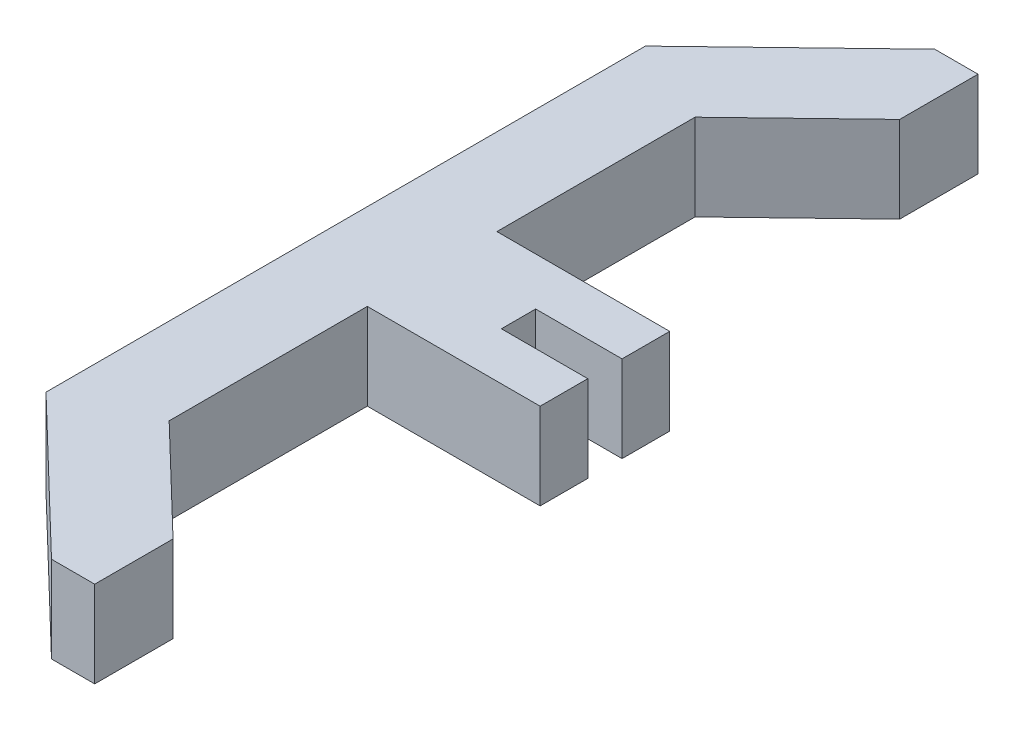
ISO-10303-21;
HEADER;
FILE_DESCRIPTION(('STEP AP214'),'2;1');
FILE_NAME('part.step','',(''),(''),'','','');
FILE_SCHEMA(('AUTOMOTIVE_DESIGN { 1 0 10303 214 1 1 1 1 }'));
ENDSEC;
DATA;
#1=APPLICATION_CONTEXT('core data for automotive mechanical design processes');
#2=APPLICATION_PROTOCOL_DEFINITION('international standard','automotive_design',2000,#1);
#3=PRODUCT_CONTEXT('',#1,'mechanical');
#4=PRODUCT('Part','Part','',(#3));
#5=PRODUCT_RELATED_PRODUCT_CATEGORY('part','',(#4));
#6=PRODUCT_DEFINITION_FORMATION('','',#4);
#7=PRODUCT_DEFINITION_CONTEXT('part definition',#1,'design');
#8=PRODUCT_DEFINITION('design','',#6,#7);
#9=PRODUCT_DEFINITION_SHAPE('','',#8);
#10=(LENGTH_UNIT() NAMED_UNIT(*) SI_UNIT(.MILLI.,.METRE.));
#11=(NAMED_UNIT(*) PLANE_ANGLE_UNIT() SI_UNIT($,.RADIAN.));
#12=(NAMED_UNIT(*) SI_UNIT($,.STERADIAN.) SOLID_ANGLE_UNIT());
#13=UNCERTAINTY_MEASURE_WITH_UNIT(LENGTH_MEASURE(1.E-05),#10,'distance_accuracy_value','');
#14=(GEOMETRIC_REPRESENTATION_CONTEXT(3) GLOBAL_UNCERTAINTY_ASSIGNED_CONTEXT((#13)) GLOBAL_UNIT_ASSIGNED_CONTEXT((#10,
#11,#12)) REPRESENTATION_CONTEXT('',''));
#15=CARTESIAN_POINT('',(0.,0.,0.));
#16=DIRECTION('',(0.,0.,1.));
#17=DIRECTION('',(1.,0.,0.));
#18=AXIS2_PLACEMENT_3D('',#15,#16,#17);
#19=CARTESIAN_POINT('',(-4.35,-75.2,-0.396875));
#20=DIRECTION('',(-1.,0.,0.));
#21=DIRECTION('',(0.,0.,1.));
#22=AXIS2_PLACEMENT_3D('',#19,#20,#21);
#23=PLANE('',#22);
#24=DIRECTION('',(0.,0.,-1.));
#25=VECTOR('',#24,1.);
#26=CARTESIAN_POINT('',(-4.35,-77.2,-0.396875));
#27=LINE('',#26,#25);
#28=CARTESIAN_POINT('',(-4.35,-77.2,-0.396875));
#29=VERTEX_POINT('',#28);
#30=CARTESIAN_POINT('',(-4.35,-77.2,-1.5));
#31=VERTEX_POINT('',#30);
#32=EDGE_CURVE('E190',#29,#31,#27,.T.);
#33=ORIENTED_EDGE('',*,*,#32,.T.);
#34=DIRECTION('',(0.,-1.,0.));
#35=VECTOR('',#34,1.);
#36=CARTESIAN_POINT('',(-4.35,-75.2,-1.5));
#37=LINE('',#36,#35);
#38=CARTESIAN_POINT('',(-4.35,-75.2,-1.5));
#39=VERTEX_POINT('',#38);
#40=EDGE_CURVE('E11',#39,#31,#37,.T.);
#41=ORIENTED_EDGE('',*,*,#40,.F.);
#42=DIRECTION('',(0.,0.,-1.));
#43=VECTOR('',#42,1.);
#44=CARTESIAN_POINT('',(-4.35,-75.2,-0.396875));
#45=LINE('',#44,#43);
#46=CARTESIAN_POINT('',(-4.35,-75.2,-0.396875));
#47=VERTEX_POINT('',#46);
#48=EDGE_CURVE('E233',#47,#39,#45,.T.);
#49=ORIENTED_EDGE('',*,*,#48,.F.);
#50=DIRECTION('',(0.,-1.,0.));
#51=VECTOR('',#50,1.);
#52=CARTESIAN_POINT('',(-4.35,-75.2,-0.396875));
#53=LINE('',#52,#51);
#54=EDGE_CURVE('E49',#47,#29,#53,.T.);
#55=ORIENTED_EDGE('',*,*,#54,.T.);
#56=EDGE_LOOP('',(#33,#41,#49,#55));
#57=FACE_BOUND('',#56,.T.);
#58=ADVANCED_FACE('F33',(#57),#23,.F.);
#59=CARTESIAN_POINT('',(-4.35,-75.2,-1.5));
#60=DIRECTION('',(0.,0.,1.));
#61=DIRECTION('',(1.,0.,0.));
#62=AXIS2_PLACEMENT_3D('',#59,#60,#61);
#63=PLANE('',#62);
#64=DIRECTION('',(-1.,0.,0.));
#65=VECTOR('',#64,1.);
#66=CARTESIAN_POINT('',(-4.35,-77.2,-1.5));
#67=LINE('',#66,#65);
#68=CARTESIAN_POINT('',(-8.3505,-77.2,-1.5));
#69=VERTEX_POINT('',#68);
#70=EDGE_CURVE('E192',#31,#69,#67,.T.);
#71=ORIENTED_EDGE('',*,*,#70,.T.);
#72=DIRECTION('',(0.,-1.,0.));
#73=VECTOR('',#72,1.);
#74=CARTESIAN_POINT('',(-8.3505,-75.2,-1.5));
#75=LINE('',#74,#73);
#76=CARTESIAN_POINT('',(-8.3505,-75.2,-1.5));
#77=VERTEX_POINT('',#76);
#78=EDGE_CURVE('E41',#77,#69,#75,.T.);
#79=ORIENTED_EDGE('',*,*,#78,.F.);
#80=DIRECTION('',(-1.,0.,0.));
#81=VECTOR('',#80,1.);
#82=CARTESIAN_POINT('',(-4.35,-75.2,-1.5));
#83=LINE('',#82,#81);
#84=EDGE_CURVE('E117',#39,#77,#83,.T.);
#85=ORIENTED_EDGE('',*,*,#84,.F.);
#86=ORIENTED_EDGE('',*,*,#40,.T.);
#87=EDGE_LOOP('',(#71,#79,#85,#86));
#88=FACE_BOUND('',#87,.T.);
#89=ADVANCED_FACE('F272',(#88),#63,.F.);
#90=CARTESIAN_POINT('',(-8.3505,-75.2,-6.08677659444825));
#91=DIRECTION('',(1.,0.,0.));
#92=DIRECTION('',(0.,0.,-1.));
#93=AXIS2_PLACEMENT_3D('',#90,#91,#92);
#94=PLANE('',#93);
#95=DIRECTION('',(0.,0.,1.));
#96=VECTOR('',#95,1.);
#97=CARTESIAN_POINT('',(-8.3505,-77.2,-6.08677659444825));
#98=LINE('',#97,#96);
#99=CARTESIAN_POINT('',(-8.3505,-77.2,-6.08677659444825));
#100=VERTEX_POINT('',#99);
#101=EDGE_CURVE('E195',#100,#69,#98,.T.);
#102=ORIENTED_EDGE('',*,*,#101,.F.);
#103=DIRECTION('',(0.,-1.,0.));
#104=VECTOR('',#103,1.);
#105=CARTESIAN_POINT('',(-8.3505,-75.2,-6.08677659444825));
#106=LINE('',#105,#104);
#107=CARTESIAN_POINT('',(-8.3505,-75.2,-6.08677659444825));
#108=VERTEX_POINT('',#107);
#109=EDGE_CURVE('E265',#108,#100,#106,.T.);
#110=ORIENTED_EDGE('',*,*,#109,.F.);
#111=DIRECTION('',(0.,0.,1.));
#112=VECTOR('',#111,1.);
#113=CARTESIAN_POINT('',(-8.3505,-75.2,-6.08677659444825));
#114=LINE('',#113,#112);
#115=EDGE_CURVE('E271',#108,#77,#114,.T.);
#116=ORIENTED_EDGE('',*,*,#115,.T.);
#117=ORIENTED_EDGE('',*,*,#78,.T.);
#118=EDGE_LOOP('',(#102,#110,#116,#117));
#119=FACE_BOUND('',#118,.T.);
#120=ADVANCED_FACE('F269',(#119),#94,.T.);
#121=CARTESIAN_POINT('',(-5.9375,-75.2,-8.40998725955227));
#122=DIRECTION('',(0.693576785787468,0.,0.720382705384245));
#123=DIRECTION('',(0.720382705384245,0.,-0.693576785787469));
#124=AXIS2_PLACEMENT_3D('',#121,#122,#123);
#125=PLANE('',#124);
#126=DIRECTION('',(-0.720382705384245,0.,0.693576785787468));
#127=VECTOR('',#126,1.);
#128=CARTESIAN_POINT('',(-5.9375,-77.2,-8.40998725955227));
#129=LINE('',#128,#127);
#130=CARTESIAN_POINT('',(-5.9375,-77.2,-8.40998725955227));
#131=VERTEX_POINT('',#130);
#132=EDGE_CURVE('E198',#131,#100,#129,.T.);
#133=ORIENTED_EDGE('',*,*,#132,.F.);
#134=DIRECTION('',(0.,-1.,0.));
#135=VECTOR('',#134,1.);
#136=CARTESIAN_POINT('',(-5.9375,-75.2,-8.40998725955227));
#137=LINE('',#136,#135);
#138=CARTESIAN_POINT('',(-5.9375,-75.2,-8.40998725955227));
#139=VERTEX_POINT('',#138);
#140=EDGE_CURVE('E263',#139,#131,#137,.T.);
#141=ORIENTED_EDGE('',*,*,#140,.F.);
#142=DIRECTION('',(-0.720382705384245,0.,0.693576785787468));
#143=VECTOR('',#142,1.);
#144=CARTESIAN_POINT('',(-5.9375,-75.2,-8.40998725955227));
#145=LINE('',#144,#143);
#146=EDGE_CURVE('E283',#139,#108,#145,.T.);
#147=ORIENTED_EDGE('',*,*,#146,.T.);
#148=ORIENTED_EDGE('',*,*,#109,.T.);
#149=EDGE_LOOP('',(#133,#141,#147,#148));
#150=FACE_BOUND('',#149,.T.);
#151=ADVANCED_FACE('F280',(#150),#125,.T.);
#152=CARTESIAN_POINT('',(-5.9375,-75.2,-10.2235));
#153=DIRECTION('',(1.,0.,0.));
#154=DIRECTION('',(0.,0.,-1.));
#155=AXIS2_PLACEMENT_3D('',#152,#153,#154);
#156=PLANE('',#155);
#157=DIRECTION('',(0.,0.,1.));
#158=VECTOR('',#157,1.);
#159=CARTESIAN_POINT('',(-5.9375,-77.2,-10.2235));
#160=LINE('',#159,#158);
#161=CARTESIAN_POINT('',(-5.9375,-77.2,-10.2235));
#162=VERTEX_POINT('',#161);
#163=EDGE_CURVE('E201',#162,#131,#160,.T.);
#164=ORIENTED_EDGE('',*,*,#163,.F.);
#165=DIRECTION('',(0.,-1.,0.));
#166=VECTOR('',#165,1.);
#167=CARTESIAN_POINT('',(-5.9375,-75.2,-10.2235));
#168=LINE('',#167,#166);
#169=CARTESIAN_POINT('',(-5.9375,-75.2,-10.2235));
#170=VERTEX_POINT('',#169);
#171=EDGE_CURVE('E261',#170,#162,#168,.T.);
#172=ORIENTED_EDGE('',*,*,#171,.F.);
#173=DIRECTION('',(0.,0.,1.));
#174=VECTOR('',#173,1.);
#175=CARTESIAN_POINT('',(-5.9375,-75.2,-10.2235));
#176=LINE('',#175,#174);
#177=EDGE_CURVE('E287',#170,#139,#176,.T.);
#178=ORIENTED_EDGE('',*,*,#177,.T.);
#179=ORIENTED_EDGE('',*,*,#140,.T.);
#180=EDGE_LOOP('',(#164,#172,#178,#179));
#181=FACE_BOUND('',#180,.T.);
#182=ADVANCED_FACE('F343',(#181),#156,.T.);
#183=CARTESIAN_POINT('',(-5.9375,-75.2,-10.2235));
#184=DIRECTION('',(0.,0.,1.));
#185=DIRECTION('',(1.,0.,0.));
#186=AXIS2_PLACEMENT_3D('',#183,#184,#185);
#187=PLANE('',#186);
#188=DIRECTION('',(-1.,0.,0.));
#189=VECTOR('',#188,1.);
#190=CARTESIAN_POINT('',(-5.9375,-77.2,-10.2235));
#191=LINE('',#190,#189);
#192=CARTESIAN_POINT('',(-6.9375,-77.2,-10.2235));
#193=VERTEX_POINT('',#192);
#194=EDGE_CURVE('E204',#162,#193,#191,.T.);
#195=ORIENTED_EDGE('',*,*,#194,.T.);
#196=DIRECTION('',(0.,-1.,0.));
#197=VECTOR('',#196,1.);
#198=CARTESIAN_POINT('',(-6.9375,-75.2,-10.2235));
#199=LINE('',#198,#197);
#200=CARTESIAN_POINT('',(-6.9375,-75.2,-10.2235));
#201=VERTEX_POINT('',#200);
#202=EDGE_CURVE('E258',#201,#193,#199,.T.);
#203=ORIENTED_EDGE('',*,*,#202,.F.);
#204=DIRECTION('',(-1.,0.,0.));
#205=VECTOR('',#204,1.);
#206=CARTESIAN_POINT('',(-5.9375,-75.2,-10.2235));
#207=LINE('',#206,#205);
#208=EDGE_CURVE('E293',#170,#201,#207,.T.);
#209=ORIENTED_EDGE('',*,*,#208,.F.);
#210=ORIENTED_EDGE('',*,*,#171,.T.);
#211=EDGE_LOOP('',(#195,#203,#209,#210));
#212=FACE_BOUND('',#211,.T.);
#213=ADVANCED_FACE('F346',(#212),#187,.F.);
#214=CARTESIAN_POINT('',(-6.9375,-75.2,-10.2235));
#215=DIRECTION('',(0.693576785787469,0.,0.720382705384245));
#216=DIRECTION('',(0.720382705384245,0.,-0.693576785787469));
#217=AXIS2_PLACEMENT_3D('',#214,#215,#216);
#218=PLANE('',#217);
#219=DIRECTION('',(-0.720382705384245,0.,0.693576785787469));
#220=VECTOR('',#219,1.);
#221=CARTESIAN_POINT('',(-6.9375,-77.2,-10.2235));
#222=LINE('',#221,#220);
#223=CARTESIAN_POINT('',(-10.3505,-77.2,-6.9375));
#224=VERTEX_POINT('',#223);
#225=EDGE_CURVE('E206',#193,#224,#222,.T.);
#226=ORIENTED_EDGE('',*,*,#225,.T.);
#227=DIRECTION('',(0.,-1.,0.));
#228=VECTOR('',#227,1.);
#229=CARTESIAN_POINT('',(-10.3505,-75.2,-6.9375));
#230=LINE('',#229,#228);
#231=CARTESIAN_POINT('',(-10.3505,-75.2,-6.9375));
#232=VERTEX_POINT('',#231);
#233=EDGE_CURVE('E255',#232,#224,#230,.T.);
#234=ORIENTED_EDGE('',*,*,#233,.F.);
#235=DIRECTION('',(-0.720382705384245,0.,0.693576785787469));
#236=VECTOR('',#235,1.);
#237=CARTESIAN_POINT('',(-6.9375,-75.2,-10.2235));
#238=LINE('',#237,#236);
#239=EDGE_CURVE('E295',#201,#232,#238,.T.);
#240=ORIENTED_EDGE('',*,*,#239,.F.);
#241=ORIENTED_EDGE('',*,*,#202,.T.);
#242=EDGE_LOOP('',(#226,#234,#240,#241));
#243=FACE_BOUND('',#242,.T.);
#244=ADVANCED_FACE('F350',(#243),#218,.F.);
#245=CARTESIAN_POINT('',(-10.3505,-75.2,-6.9375));
#246=DIRECTION('',(1.,0.,0.));
#247=DIRECTION('',(0.,0.,-1.));
#248=AXIS2_PLACEMENT_3D('',#245,#246,#247);
#249=PLANE('',#248);
#250=DIRECTION('',(0.,0.,1.));
#251=VECTOR('',#250,1.);
#252=CARTESIAN_POINT('',(-10.3505,-77.2,-6.9375));
#253=LINE('',#252,#251);
#254=CARTESIAN_POINT('',(-10.3505,-77.2,6.9375));
#255=VERTEX_POINT('',#254);
#256=EDGE_CURVE('E208',#224,#255,#253,.T.);
#257=ORIENTED_EDGE('',*,*,#256,.T.);
#258=DIRECTION('',(0.,-1.,0.));
#259=VECTOR('',#258,1.);
#260=CARTESIAN_POINT('',(-10.3505,-75.2,6.9375));
#261=LINE('',#260,#259);
#262=CARTESIAN_POINT('',(-10.3505,-75.2,6.9375));
#263=VERTEX_POINT('',#262);
#264=EDGE_CURVE('E253',#263,#255,#261,.T.);
#265=ORIENTED_EDGE('',*,*,#264,.F.);
#266=DIRECTION('',(0.,0.,1.));
#267=VECTOR('',#266,1.);
#268=CARTESIAN_POINT('',(-10.3505,-75.2,-6.9375));
#269=LINE('',#268,#267);
#270=EDGE_CURVE('E297',#232,#263,#269,.T.);
#271=ORIENTED_EDGE('',*,*,#270,.F.);
#272=ORIENTED_EDGE('',*,*,#233,.T.);
#273=EDGE_LOOP('',(#257,#265,#271,#272));
#274=FACE_BOUND('',#273,.T.);
#275=ADVANCED_FACE('F354',(#274),#249,.F.);
#276=CARTESIAN_POINT('',(-6.9375,-75.2,10.2235));
#277=DIRECTION('',(-0.693576785787469,0.,0.720382705384245));
#278=DIRECTION('',(0.720382705384245,0.,0.693576785787469));
#279=AXIS2_PLACEMENT_3D('',#276,#277,#278);
#280=PLANE('',#279);
#281=DIRECTION('',(-0.720382705384245,0.,-0.693576785787469));
#282=VECTOR('',#281,1.);
#283=CARTESIAN_POINT('',(-6.9375,-77.2,10.2235));
#284=LINE('',#283,#282);
#285=CARTESIAN_POINT('',(-6.9375,-77.2,10.2235));
#286=VERTEX_POINT('',#285);
#287=EDGE_CURVE('E211',#286,#255,#284,.T.);
#288=ORIENTED_EDGE('',*,*,#287,.F.);
#289=DIRECTION('',(0.,-1.,0.));
#290=VECTOR('',#289,1.);
#291=CARTESIAN_POINT('',(-6.9375,-75.2,10.2235));
#292=LINE('',#291,#290);
#293=CARTESIAN_POINT('',(-6.9375,-75.2,10.2235));
#294=VERTEX_POINT('',#293);
#295=EDGE_CURVE('E251',#294,#286,#292,.T.);
#296=ORIENTED_EDGE('',*,*,#295,.F.);
#297=DIRECTION('',(-0.720382705384245,0.,-0.693576785787469));
#298=VECTOR('',#297,1.);
#299=CARTESIAN_POINT('',(-6.9375,-75.2,10.2235));
#300=LINE('',#299,#298);
#301=EDGE_CURVE('E299',#294,#263,#300,.T.);
#302=ORIENTED_EDGE('',*,*,#301,.T.);
#303=ORIENTED_EDGE('',*,*,#264,.T.);
#304=EDGE_LOOP('',(#288,#296,#302,#303));
#305=FACE_BOUND('',#304,.T.);
#306=ADVANCED_FACE('F358',(#305),#280,.T.);
#307=CARTESIAN_POINT('',(-5.9375,-75.2,10.2235));
#308=DIRECTION('',(0.,0.,1.));
#309=DIRECTION('',(1.,0.,0.));
#310=AXIS2_PLACEMENT_3D('',#307,#308,#309);
#311=PLANE('',#310);
#312=DIRECTION('',(-1.,0.,0.));
#313=VECTOR('',#312,1.);
#314=CARTESIAN_POINT('',(-5.9375,-77.2,10.2235));
#315=LINE('',#314,#313);
#316=CARTESIAN_POINT('',(-5.9375,-77.2,10.2235));
#317=VERTEX_POINT('',#316);
#318=EDGE_CURVE('E214',#317,#286,#315,.T.);
#319=ORIENTED_EDGE('',*,*,#318,.F.);
#320=DIRECTION('',(0.,-1.,0.));
#321=VECTOR('',#320,1.);
#322=CARTESIAN_POINT('',(-5.9375,-75.2,10.2235));
#323=LINE('',#322,#321);
#324=CARTESIAN_POINT('',(-5.9375,-75.2,10.2235));
#325=VERTEX_POINT('',#324);
#326=EDGE_CURVE('E249',#325,#317,#323,.T.);
#327=ORIENTED_EDGE('',*,*,#326,.F.);
#328=DIRECTION('',(-1.,0.,0.));
#329=VECTOR('',#328,1.);
#330=CARTESIAN_POINT('',(-5.9375,-75.2,10.2235));
#331=LINE('',#330,#329);
#332=EDGE_CURVE('E302',#325,#294,#331,.T.);
#333=ORIENTED_EDGE('',*,*,#332,.T.);
#334=ORIENTED_EDGE('',*,*,#295,.T.);
#335=EDGE_LOOP('',(#319,#327,#333,#334));
#336=FACE_BOUND('',#335,.T.);
#337=ADVANCED_FACE('F362',(#336),#311,.T.);
#338=CARTESIAN_POINT('',(-5.9375,-75.2,10.2235));
#339=DIRECTION('',(-1.,0.,0.));
#340=DIRECTION('',(0.,0.,1.));
#341=AXIS2_PLACEMENT_3D('',#338,#339,#340);
#342=PLANE('',#341);
#343=DIRECTION('',(0.,0.,-1.));
#344=VECTOR('',#343,1.);
#345=CARTESIAN_POINT('',(-5.9375,-77.2,10.2235));
#346=LINE('',#345,#344);
#347=CARTESIAN_POINT('',(-5.9375,-77.2,8.40998725955227));
#348=VERTEX_POINT('',#347);
#349=EDGE_CURVE('E217',#317,#348,#346,.T.);
#350=ORIENTED_EDGE('',*,*,#349,.T.);
#351=DIRECTION('',(0.,-1.,0.));
#352=VECTOR('',#351,1.);
#353=CARTESIAN_POINT('',(-5.9375,-75.2,8.40998725955227));
#354=LINE('',#353,#352);
#355=CARTESIAN_POINT('',(-5.9375,-75.2,8.40998725955227));
#356=VERTEX_POINT('',#355);
#357=EDGE_CURVE('E246',#356,#348,#354,.T.);
#358=ORIENTED_EDGE('',*,*,#357,.F.);
#359=DIRECTION('',(0.,0.,-1.));
#360=VECTOR('',#359,1.);
#361=CARTESIAN_POINT('',(-5.9375,-75.2,10.2235));
#362=LINE('',#361,#360);
#363=EDGE_CURVE('E305',#325,#356,#362,.T.);
#364=ORIENTED_EDGE('',*,*,#363,.F.);
#365=ORIENTED_EDGE('',*,*,#326,.T.);
#366=EDGE_LOOP('',(#350,#358,#364,#365));
#367=FACE_BOUND('',#366,.T.);
#368=ADVANCED_FACE('F366',(#367),#342,.F.);
#369=CARTESIAN_POINT('',(-5.9375,-75.2,8.40998725955227));
#370=DIRECTION('',(-0.693576785787468,0.,0.720382705384245));
#371=DIRECTION('',(0.720382705384245,0.,0.693576785787469));
#372=AXIS2_PLACEMENT_3D('',#369,#370,#371);
#373=PLANE('',#372);
#374=DIRECTION('',(-0.720382705384245,0.,-0.693576785787468));
#375=VECTOR('',#374,1.);
#376=CARTESIAN_POINT('',(-5.9375,-77.2,8.40998725955227));
#377=LINE('',#376,#375);
#378=CARTESIAN_POINT('',(-8.3505,-77.2,6.08677659444825));
#379=VERTEX_POINT('',#378);
#380=EDGE_CURVE('E219',#348,#379,#377,.T.);
#381=ORIENTED_EDGE('',*,*,#380,.T.);
#382=DIRECTION('',(0.,-1.,0.));
#383=VECTOR('',#382,1.);
#384=CARTESIAN_POINT('',(-8.3505,-75.2,6.08677659444825));
#385=LINE('',#384,#383);
#386=CARTESIAN_POINT('',(-8.3505,-75.2,6.08677659444825));
#387=VERTEX_POINT('',#386);
#388=EDGE_CURVE('E243',#387,#379,#385,.T.);
#389=ORIENTED_EDGE('',*,*,#388,.F.);
#390=DIRECTION('',(-0.720382705384245,0.,-0.693576785787468));
#391=VECTOR('',#390,1.);
#392=CARTESIAN_POINT('',(-5.9375,-75.2,8.40998725955227));
#393=LINE('',#392,#391);
#394=EDGE_CURVE('E307',#356,#387,#393,.T.);
#395=ORIENTED_EDGE('',*,*,#394,.F.);
#396=ORIENTED_EDGE('',*,*,#357,.T.);
#397=EDGE_LOOP('',(#381,#389,#395,#396));
#398=FACE_BOUND('',#397,.T.);
#399=ADVANCED_FACE('F370',(#398),#373,.F.);
#400=CARTESIAN_POINT('',(-8.3505,-75.2,6.08677659444825));
#401=DIRECTION('',(-1.,0.,0.));
#402=DIRECTION('',(0.,0.,1.));
#403=AXIS2_PLACEMENT_3D('',#400,#401,#402);
#404=PLANE('',#403);
#405=DIRECTION('',(0.,0.,-1.));
#406=VECTOR('',#405,1.);
#407=CARTESIAN_POINT('',(-8.3505,-77.2,6.08677659444825));
#408=LINE('',#407,#406);
#409=CARTESIAN_POINT('',(-8.3505,-77.2,1.5));
#410=VERTEX_POINT('',#409);
#411=EDGE_CURVE('E221',#379,#410,#408,.T.);
#412=ORIENTED_EDGE('',*,*,#411,.T.);
#413=DIRECTION('',(0.,-1.,0.));
#414=VECTOR('',#413,1.);
#415=CARTESIAN_POINT('',(-8.3505,-75.2,1.5));
#416=LINE('',#415,#414);
#417=CARTESIAN_POINT('',(-8.3505,-75.2,1.5));
#418=VERTEX_POINT('',#417);
#419=EDGE_CURVE('E240',#418,#410,#416,.T.);
#420=ORIENTED_EDGE('',*,*,#419,.F.);
#421=DIRECTION('',(0.,0.,-1.));
#422=VECTOR('',#421,1.);
#423=CARTESIAN_POINT('',(-8.3505,-75.2,6.08677659444825));
#424=LINE('',#423,#422);
#425=EDGE_CURVE('E309',#387,#418,#424,.T.);
#426=ORIENTED_EDGE('',*,*,#425,.F.);
#427=ORIENTED_EDGE('',*,*,#388,.T.);
#428=EDGE_LOOP('',(#412,#420,#426,#427));
#429=FACE_BOUND('',#428,.T.);
#430=ADVANCED_FACE('F374',(#429),#404,.F.);
#431=CARTESIAN_POINT('',(-8.3505,-75.2,1.5));
#432=DIRECTION('',(0.,0.,-1.));
#433=DIRECTION('',(-1.,0.,0.));
#434=AXIS2_PLACEMENT_3D('',#431,#432,#433);
#435=PLANE('',#434);
#436=DIRECTION('',(1.,0.,0.));
#437=VECTOR('',#436,1.);
#438=CARTESIAN_POINT('',(-8.3505,-77.2,1.5));
#439=LINE('',#438,#437);
#440=CARTESIAN_POINT('',(-4.35,-77.2,1.5));
#441=VERTEX_POINT('',#440);
#442=EDGE_CURVE('E223',#410,#441,#439,.T.);
#443=ORIENTED_EDGE('',*,*,#442,.T.);
#444=DIRECTION('',(0.,-1.,0.));
#445=VECTOR('',#444,1.);
#446=CARTESIAN_POINT('',(-4.35,-75.2,1.5));
#447=LINE('',#446,#445);
#448=CARTESIAN_POINT('',(-4.35,-75.2,1.5));
#449=VERTEX_POINT('',#448);
#450=EDGE_CURVE('E237',#449,#441,#447,.T.);
#451=ORIENTED_EDGE('',*,*,#450,.F.);
#452=DIRECTION('',(1.,0.,0.));
#453=VECTOR('',#452,1.);
#454=CARTESIAN_POINT('',(-8.3505,-75.2,1.5));
#455=LINE('',#454,#453);
#456=EDGE_CURVE('E311',#418,#449,#455,.T.);
#457=ORIENTED_EDGE('',*,*,#456,.F.);
#458=ORIENTED_EDGE('',*,*,#419,.T.);
#459=EDGE_LOOP('',(#443,#451,#457,#458));
#460=FACE_BOUND('',#459,.T.);
#461=ADVANCED_FACE('F317',(#460),#435,.F.);
#462=CARTESIAN_POINT('',(-4.35,-75.2,1.5));
#463=DIRECTION('',(-1.,0.,0.));
#464=DIRECTION('',(0.,0.,1.));
#465=AXIS2_PLACEMENT_3D('',#462,#463,#464);
#466=PLANE('',#465);
#467=DIRECTION('',(0.,0.,-1.));
#468=VECTOR('',#467,1.);
#469=CARTESIAN_POINT('',(-4.35,-77.2,1.5));
#470=LINE('',#469,#468);
#471=CARTESIAN_POINT('',(-4.35,-77.2,0.396875000000002));
#472=VERTEX_POINT('',#471);
#473=EDGE_CURVE('E225',#441,#472,#470,.T.);
#474=ORIENTED_EDGE('',*,*,#473,.T.);
#475=DIRECTION('',(0.,-1.,0.));
#476=VECTOR('',#475,1.);
#477=CARTESIAN_POINT('',(-4.35,-75.2,0.396875000000002));
#478=LINE('',#477,#476);
#479=CARTESIAN_POINT('',(-4.35,-75.2,0.396875000000002));
#480=VERTEX_POINT('',#479);
#481=EDGE_CURVE('E182',#480,#472,#478,.T.);
#482=ORIENTED_EDGE('',*,*,#481,.F.);
#483=DIRECTION('',(0.,0.,-1.));
#484=VECTOR('',#483,1.);
#485=CARTESIAN_POINT('',(-4.35,-75.2,1.5));
#486=LINE('',#485,#484);
#487=EDGE_CURVE('E170',#449,#480,#486,.T.);
#488=ORIENTED_EDGE('',*,*,#487,.F.);
#489=ORIENTED_EDGE('',*,*,#450,.T.);
#490=EDGE_LOOP('',(#474,#482,#488,#489));
#491=FACE_BOUND('',#490,.T.);
#492=ADVANCED_FACE('F321',(#491),#466,.F.);
#493=CARTESIAN_POINT('',(-4.35,-75.2,0.396875000000002));
#494=DIRECTION('',(0.,0.,1.));
#495=DIRECTION('',(1.,0.,0.));
#496=AXIS2_PLACEMENT_3D('',#493,#494,#495);
#497=PLANE('',#496);
#498=DIRECTION('',(-1.,0.,0.));
#499=VECTOR('',#498,1.);
#500=CARTESIAN_POINT('',(-4.35,-77.2,0.396875000000002));
#501=LINE('',#500,#499);
#502=CARTESIAN_POINT('',(-6.35,-77.2,0.396875));
#503=VERTEX_POINT('',#502);
#504=EDGE_CURVE('E179',#472,#503,#501,.T.);
#505=ORIENTED_EDGE('',*,*,#504,.T.);
#506=DIRECTION('',(0.,-1.,0.));
#507=VECTOR('',#506,1.);
#508=CARTESIAN_POINT('',(-6.35,-75.2,0.396875));
#509=LINE('',#508,#507);
#510=CARTESIAN_POINT('',(-6.35,-75.2,0.396875));
#511=VERTEX_POINT('',#510);
#512=EDGE_CURVE('E176',#511,#503,#509,.T.);
#513=ORIENTED_EDGE('',*,*,#512,.F.);
#514=DIRECTION('',(-1.,0.,0.));
#515=VECTOR('',#514,1.);
#516=CARTESIAN_POINT('',(-4.35,-75.2,0.396875000000002));
#517=LINE('',#516,#515);
#518=EDGE_CURVE('E163',#480,#511,#517,.T.);
#519=ORIENTED_EDGE('',*,*,#518,.F.);
#520=ORIENTED_EDGE('',*,*,#481,.T.);
#521=EDGE_LOOP('',(#505,#513,#519,#520));
#522=FACE_BOUND('',#521,.T.);
#523=ADVANCED_FACE('F177',(#522),#497,.F.);
#524=CARTESIAN_POINT('',(-6.35,-75.2,-0.396875));
#525=DIRECTION('',(1.,0.,0.));
#526=DIRECTION('',(0.,0.,-1.));
#527=AXIS2_PLACEMENT_3D('',#524,#525,#526);
#528=PLANE('',#527);
#529=DIRECTION('',(0.,0.,1.));
#530=VECTOR('',#529,1.);
#531=CARTESIAN_POINT('',(-6.35,-77.2,-0.396875));
#532=LINE('',#531,#530);
#533=CARTESIAN_POINT('',(-6.35,-77.2,-0.396875));
#534=VERTEX_POINT('',#533);
#535=EDGE_CURVE('E228',#534,#503,#532,.T.);
#536=ORIENTED_EDGE('',*,*,#535,.F.);
#537=DIRECTION('',(0.,-1.,0.));
#538=VECTOR('',#537,1.);
#539=CARTESIAN_POINT('',(-6.35,-75.2,-0.396875));
#540=LINE('',#539,#538);
#541=CARTESIAN_POINT('',(-6.35,-75.2,-0.396875));
#542=VERTEX_POINT('',#541);
#543=EDGE_CURVE('E105',#542,#534,#540,.T.);
#544=ORIENTED_EDGE('',*,*,#543,.F.);
#545=DIRECTION('',(0.,0.,1.));
#546=VECTOR('',#545,1.);
#547=CARTESIAN_POINT('',(-6.35,-75.2,-0.396875));
#548=LINE('',#547,#546);
#549=EDGE_CURVE('E168',#542,#511,#548,.T.);
#550=ORIENTED_EDGE('',*,*,#549,.T.);
#551=ORIENTED_EDGE('',*,*,#512,.T.);
#552=EDGE_LOOP('',(#536,#544,#550,#551));
#553=FACE_BOUND('',#552,.T.);
#554=ADVANCED_FACE('F184',(#553),#528,.T.);
#555=CARTESIAN_POINT('',(-4.35,-75.2,-0.396875));
#556=DIRECTION('',(0.,0.,1.));
#557=DIRECTION('',(1.,0.,0.));
#558=AXIS2_PLACEMENT_3D('',#555,#556,#557);
#559=PLANE('',#558);
#560=DIRECTION('',(-1.,0.,0.));
#561=VECTOR('',#560,1.);
#562=CARTESIAN_POINT('',(-4.35,-77.2,-0.396875));
#563=LINE('',#562,#561);
#564=EDGE_CURVE('E230',#29,#534,#563,.T.);
#565=ORIENTED_EDGE('',*,*,#564,.F.);
#566=ORIENTED_EDGE('',*,*,#54,.F.);
#567=DIRECTION('',(-1.,0.,0.));
#568=VECTOR('',#567,1.);
#569=CARTESIAN_POINT('',(-4.35,-75.2,-0.396875));
#570=LINE('',#569,#568);
#571=EDGE_CURVE('E185',#47,#542,#570,.T.);
#572=ORIENTED_EDGE('',*,*,#571,.T.);
#573=ORIENTED_EDGE('',*,*,#543,.T.);
#574=EDGE_LOOP('',(#565,#566,#572,#573));
#575=FACE_BOUND('',#574,.T.);
#576=ADVANCED_FACE('F322',(#575),#559,.T.);
#577=CARTESIAN_POINT('',(0.,-75.2,0.));
#578=DIRECTION('',(0.,1.,0.));
#579=DIRECTION('',(0.,0.,1.));
#580=AXIS2_PLACEMENT_3D('',#577,#578,#579);
#581=PLANE('',#580);
#582=ORIENTED_EDGE('',*,*,#48,.T.);
#583=ORIENTED_EDGE('',*,*,#84,.T.);
#584=ORIENTED_EDGE('',*,*,#115,.F.);
#585=ORIENTED_EDGE('',*,*,#146,.F.);
#586=ORIENTED_EDGE('',*,*,#177,.F.);
#587=ORIENTED_EDGE('',*,*,#208,.T.);
#588=ORIENTED_EDGE('',*,*,#239,.T.);
#589=ORIENTED_EDGE('',*,*,#270,.T.);
#590=ORIENTED_EDGE('',*,*,#301,.F.);
#591=ORIENTED_EDGE('',*,*,#332,.F.);
#592=ORIENTED_EDGE('',*,*,#363,.T.);
#593=ORIENTED_EDGE('',*,*,#394,.T.);
#594=ORIENTED_EDGE('',*,*,#425,.T.);
#595=ORIENTED_EDGE('',*,*,#456,.T.);
#596=ORIENTED_EDGE('',*,*,#487,.T.);
#597=ORIENTED_EDGE('',*,*,#518,.T.);
#598=ORIENTED_EDGE('',*,*,#549,.F.);
#599=ORIENTED_EDGE('',*,*,#571,.F.);
#600=EDGE_LOOP('',(#582,#583,#584,#585,#586,#587,#588,#589,#590,#591,#592,#593,#594,#595,#596,
#597,#598,#599));
#601=FACE_BOUND('',#600,.T.);
#602=ADVANCED_FACE('F165',(#601),#581,.T.);
#603=CARTESIAN_POINT('',(0.,-77.2,0.));
#604=DIRECTION('',(0.,1.,0.));
#605=DIRECTION('',(0.,0.,1.));
#606=AXIS2_PLACEMENT_3D('',#603,#604,#605);
#607=PLANE('',#606);
#608=ORIENTED_EDGE('',*,*,#32,.F.);
#609=ORIENTED_EDGE('',*,*,#564,.T.);
#610=ORIENTED_EDGE('',*,*,#535,.T.);
#611=ORIENTED_EDGE('',*,*,#504,.F.);
#612=ORIENTED_EDGE('',*,*,#473,.F.);
#613=ORIENTED_EDGE('',*,*,#442,.F.);
#614=ORIENTED_EDGE('',*,*,#411,.F.);
#615=ORIENTED_EDGE('',*,*,#380,.F.);
#616=ORIENTED_EDGE('',*,*,#349,.F.);
#617=ORIENTED_EDGE('',*,*,#318,.T.);
#618=ORIENTED_EDGE('',*,*,#287,.T.);
#619=ORIENTED_EDGE('',*,*,#256,.F.);
#620=ORIENTED_EDGE('',*,*,#225,.F.);
#621=ORIENTED_EDGE('',*,*,#194,.F.);
#622=ORIENTED_EDGE('',*,*,#163,.T.);
#623=ORIENTED_EDGE('',*,*,#132,.T.);
#624=ORIENTED_EDGE('',*,*,#101,.T.);
#625=ORIENTED_EDGE('',*,*,#70,.F.);
#626=EDGE_LOOP('',(#608,#609,#610,#611,#612,#613,#614,#615,#616,#617,#618,#619,#620,#621,#622,
#623,#624,#625));
#627=FACE_BOUND('',#626,.T.);
#628=ADVANCED_FACE('F275',(#627),#607,.F.);
#629=CLOSED_SHELL('',(#58,#89,#120,#151,#182,#213,#244,#275,#306,#337,#368,#399,#430,#461,#492,
#523,#554,#576,#602,#628));
#630=MANIFOLD_SOLID_BREP('B2',#629);
#631=ADVANCED_BREP_SHAPE_REPRESENTATION('',(#18,#630),#14);
#632=SHAPE_DEFINITION_REPRESENTATION(#9,#631);
ENDSEC;
END-ISO-10303-21;
